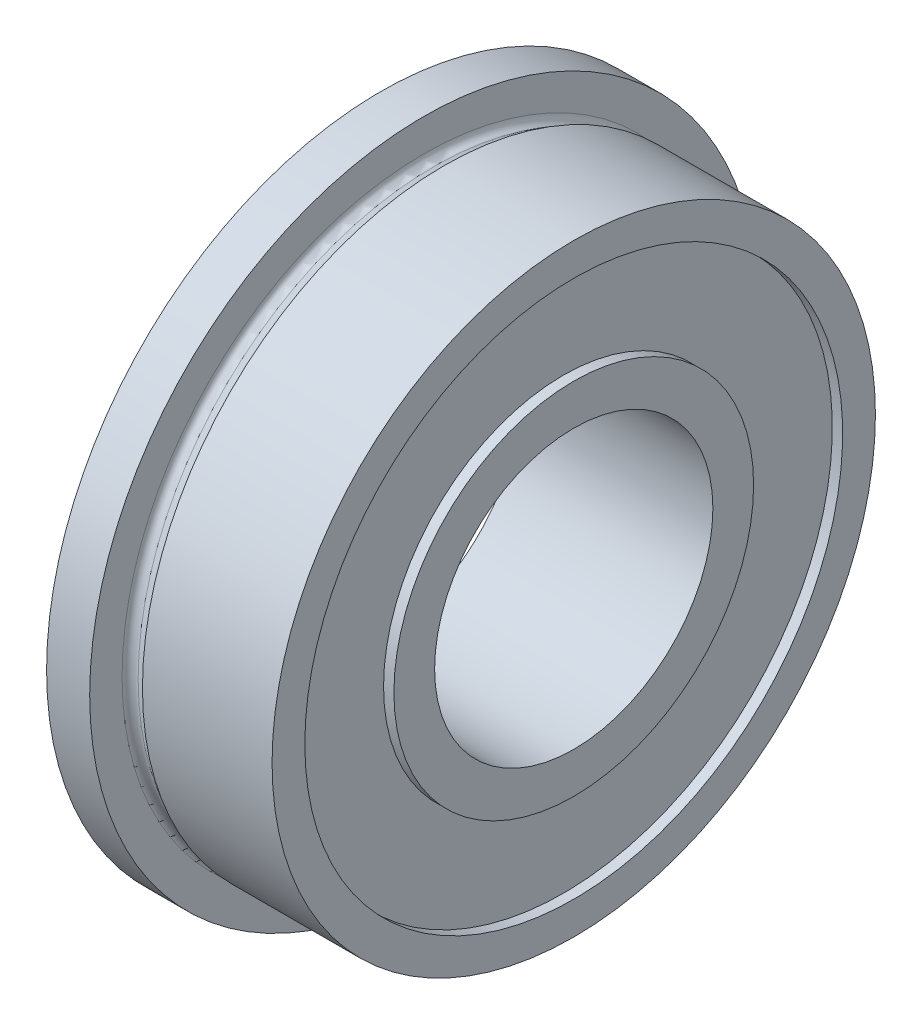
ISO-10303-21;
HEADER;
FILE_DESCRIPTION(('STEP AP214'),'2;1');
FILE_NAME('part.step','',(''),(''),'','','');
FILE_SCHEMA(('AUTOMOTIVE_DESIGN { 1 0 10303 214 1 1 1 1 }'));
ENDSEC;
DATA;
#1=APPLICATION_CONTEXT('core data for automotive mechanical design processes');
#2=APPLICATION_PROTOCOL_DEFINITION('international standard','automotive_design',2000,#1);
#3=PRODUCT_CONTEXT('',#1,'mechanical');
#4=PRODUCT('Part','Part','',(#3));
#5=PRODUCT_RELATED_PRODUCT_CATEGORY('part','',(#4));
#6=PRODUCT_DEFINITION_FORMATION('','',#4);
#7=PRODUCT_DEFINITION_CONTEXT('part definition',#1,'design');
#8=PRODUCT_DEFINITION('design','',#6,#7);
#9=PRODUCT_DEFINITION_SHAPE('','',#8);
#10=(LENGTH_UNIT() NAMED_UNIT(*) SI_UNIT(.MILLI.,.METRE.));
#11=(NAMED_UNIT(*) PLANE_ANGLE_UNIT() SI_UNIT($,.RADIAN.));
#12=(NAMED_UNIT(*) SI_UNIT($,.STERADIAN.) SOLID_ANGLE_UNIT());
#13=UNCERTAINTY_MEASURE_WITH_UNIT(LENGTH_MEASURE(1.E-05),#10,'distance_accuracy_value','');
#14=(GEOMETRIC_REPRESENTATION_CONTEXT(3) GLOBAL_UNCERTAINTY_ASSIGNED_CONTEXT((#13)) GLOBAL_UNIT_ASSIGNED_CONTEXT((#10,
#11,#12)) REPRESENTATION_CONTEXT('',''));
#15=CARTESIAN_POINT('',(0.,0.,0.));
#16=DIRECTION('',(0.,0.,1.));
#17=DIRECTION('',(1.,0.,0.));
#18=AXIS2_PLACEMENT_3D('',#15,#16,#17);
#19=CARTESIAN_POINT('',(1.9625,0.,0.));
#20=DIRECTION('',(1.,0.,0.));
#21=DIRECTION('',(0.,0.,-1.));
#22=AXIS2_PLACEMENT_3D('',#19,#20,#21);
#23=CONICAL_SURFACE('',#22,10.8959936490539,0.523598775598302);
#24=CARTESIAN_POINT('',(2.3375,0.,0.));
#25=DIRECTION('',(-1.,0.,0.));
#26=DIRECTION('',(0.,0.,1.));
#27=AXIS2_PLACEMENT_3D('',#24,#25,#26);
#28=CIRCLE('',#27,11.1125);
#29=CARTESIAN_POINT('',(2.3375,0.,11.1125));
#30=VERTEX_POINT('',#29);
#31=EDGE_CURVE('E87',#30,#30,#28,.T.);
#32=ORIENTED_EDGE('',*,*,#31,.T.);
#33=EDGE_LOOP('',(#32));
#34=FACE_BOUND('',#33,.T.);
#35=CARTESIAN_POINT('',(1.9625,0.,0.));
#36=DIRECTION('',(-1.,0.,0.));
#37=DIRECTION('',(0.,0.,1.));
#38=AXIS2_PLACEMENT_3D('',#35,#36,#37);
#39=CIRCLE('',#38,10.8959936490539);
#40=CARTESIAN_POINT('',(1.9625,0.,10.8959936490539));
#41=VERTEX_POINT('',#40);
#42=EDGE_CURVE('E10',#41,#41,#39,.T.);
#43=ORIENTED_EDGE('',*,*,#42,.F.);
#44=EDGE_LOOP('',(#43));
#45=FACE_BOUND('',#44,.T.);
#46=ADVANCED_FACE('F35',(#34,#45),#23,.T.);
#47=CARTESIAN_POINT('',(1.8375,0.,0.));
#48=DIRECTION('',(-1.,0.,0.));
#49=DIRECTION('',(0.,0.,1.));
#50=AXIS2_PLACEMENT_3D('',#47,#48,#49);
#51=TOROIDAL_SURFACE('',#50,11.1125,0.250000000000001);
#52=ORIENTED_EDGE('',*,*,#42,.T.);
#53=EDGE_LOOP('',(#52));
#54=FACE_BOUND('',#53,.T.);
#55=CARTESIAN_POINT('',(1.5875,0.,0.));
#56=DIRECTION('',(-1.,0.,0.));
#57=DIRECTION('',(0.,0.,1.));
#58=AXIS2_PLACEMENT_3D('',#55,#56,#57);
#59=CIRCLE('',#58,11.1125);
#60=CARTESIAN_POINT('',(1.5875,0.,11.1125));
#61=VERTEX_POINT('',#60);
#62=EDGE_CURVE('E41',#61,#61,#59,.T.);
#63=ORIENTED_EDGE('',*,*,#62,.F.);
#64=EDGE_LOOP('',(#63));
#65=FACE_BOUND('',#64,.T.);
#66=ADVANCED_FACE('F105',(#54,#65),#51,.F.);
#67=CARTESIAN_POINT('',(1.5875,12.3063,0.));
#68=DIRECTION('',(1.,0.,0.));
#69=DIRECTION('',(0.,0.,-1.));
#70=AXIS2_PLACEMENT_3D('',#67,#68,#69);
#71=PLANE('',#70);
#72=ORIENTED_EDGE('',*,*,#62,.T.);
#73=EDGE_LOOP('',(#72));
#74=FACE_BOUND('',#73,.T.);
#75=CARTESIAN_POINT('',(1.5875,0.,0.));
#76=DIRECTION('',(-1.,0.,0.));
#77=DIRECTION('',(0.,0.,1.));
#78=AXIS2_PLACEMENT_3D('',#75,#76,#77);
#79=CIRCLE('',#78,12.3063);
#80=CARTESIAN_POINT('',(1.5875,0.,12.3063));
#81=VERTEX_POINT('',#80);
#82=EDGE_CURVE('E45',#81,#81,#79,.T.);
#83=ORIENTED_EDGE('',*,*,#82,.F.);
#84=EDGE_LOOP('',(#83));
#85=FACE_BOUND('',#84,.T.);
#86=ADVANCED_FACE('F109',(#74,#85),#71,.T.);
#87=CARTESIAN_POINT('',(7.112,0.,0.));
#88=DIRECTION('',(-1.,0.,0.));
#89=DIRECTION('',(0.,0.,1.));
#90=AXIS2_PLACEMENT_3D('',#87,#88,#89);
#91=CYLINDRICAL_SURFACE('',#90,12.3063);
#92=ORIENTED_EDGE('',*,*,#82,.T.);
#93=EDGE_LOOP('',(#92));
#94=FACE_BOUND('',#93,.T.);
#95=CARTESIAN_POINT('',(0.,0.,0.));
#96=DIRECTION('',(-1.,0.,0.));
#97=DIRECTION('',(0.,0.,1.));
#98=AXIS2_PLACEMENT_3D('',#95,#96,#97);
#99=CIRCLE('',#98,12.3063);
#100=CARTESIAN_POINT('',(0.,0.,12.3063));
#101=VERTEX_POINT('',#100);
#102=EDGE_CURVE('E49',#101,#101,#99,.T.);
#103=ORIENTED_EDGE('',*,*,#102,.F.);
#104=EDGE_LOOP('',(#103));
#105=FACE_BOUND('',#104,.T.);
#106=ADVANCED_FACE('F113',(#94,#105),#91,.T.);
#107=CARTESIAN_POINT('',(0.,9.906,0.));
#108=DIRECTION('',(-1.,0.,0.));
#109=DIRECTION('',(0.,0.,1.));
#110=AXIS2_PLACEMENT_3D('',#107,#108,#109);
#111=PLANE('',#110);
#112=ORIENTED_EDGE('',*,*,#102,.T.);
#113=EDGE_LOOP('',(#112));
#114=FACE_BOUND('',#113,.T.);
#115=CARTESIAN_POINT('',(0.,0.,0.));
#116=DIRECTION('',(-1.,0.,0.));
#117=DIRECTION('',(0.,0.,1.));
#118=AXIS2_PLACEMENT_3D('',#115,#116,#117);
#119=CIRCLE('',#118,9.906);
#120=CARTESIAN_POINT('',(0.,0.,9.906));
#121=VERTEX_POINT('',#120);
#122=EDGE_CURVE('E54',#121,#121,#119,.T.);
#123=ORIENTED_EDGE('',*,*,#122,.F.);
#124=EDGE_LOOP('',(#123));
#125=FACE_BOUND('',#124,.T.);
#126=ADVANCED_FACE('F119',(#114,#125),#111,.T.);
#127=CARTESIAN_POINT('',(7.112,0.,0.));
#128=DIRECTION('',(-1.,0.,0.));
#129=DIRECTION('',(0.,0.,1.));
#130=AXIS2_PLACEMENT_3D('',#127,#128,#129);
#131=CYLINDRICAL_SURFACE('',#130,9.906);
#132=ORIENTED_EDGE('',*,*,#122,.T.);
#133=EDGE_LOOP('',(#132));
#134=FACE_BOUND('',#133,.T.);
#135=CARTESIAN_POINT('',(0.380999999999999,0.,0.));
#136=DIRECTION('',(-1.,0.,0.));
#137=DIRECTION('',(0.,0.,1.));
#138=AXIS2_PLACEMENT_3D('',#135,#136,#137);
#139=CIRCLE('',#138,9.906);
#140=CARTESIAN_POINT('',(0.380999999999999,0.,9.906));
#141=VERTEX_POINT('',#140);
#142=EDGE_CURVE('E57',#141,#141,#139,.T.);
#143=ORIENTED_EDGE('',*,*,#142,.F.);
#144=EDGE_LOOP('',(#143));
#145=FACE_BOUND('',#144,.T.);
#146=ADVANCED_FACE('F123',(#134,#145),#131,.F.);
#147=CARTESIAN_POINT('',(0.380999999999999,6.625,0.));
#148=DIRECTION('',(-1.,0.,0.));
#149=DIRECTION('',(0.,0.,1.));
#150=AXIS2_PLACEMENT_3D('',#147,#148,#149);
#151=PLANE('',#150);
#152=ORIENTED_EDGE('',*,*,#142,.T.);
#153=EDGE_LOOP('',(#152));
#154=FACE_BOUND('',#153,.T.);
#155=CARTESIAN_POINT('',(0.380999999999999,0.,0.));
#156=DIRECTION('',(-1.,0.,0.));
#157=DIRECTION('',(0.,0.,1.));
#158=AXIS2_PLACEMENT_3D('',#155,#156,#157);
#159=CIRCLE('',#158,6.625);
#160=CARTESIAN_POINT('',(0.380999999999999,0.,6.625));
#161=VERTEX_POINT('',#160);
#162=EDGE_CURVE('E60',#161,#161,#159,.T.);
#163=ORIENTED_EDGE('',*,*,#162,.F.);
#164=EDGE_LOOP('',(#163));
#165=FACE_BOUND('',#164,.T.);
#166=ADVANCED_FACE('F127',(#154,#165),#151,.T.);
#167=CARTESIAN_POINT('',(7.112,0.,0.));
#168=DIRECTION('',(-1.,0.,0.));
#169=DIRECTION('',(0.,0.,1.));
#170=AXIS2_PLACEMENT_3D('',#167,#168,#169);
#171=CYLINDRICAL_SURFACE('',#170,6.625);
#172=ORIENTED_EDGE('',*,*,#162,.T.);
#173=EDGE_LOOP('',(#172));
#174=FACE_BOUND('',#173,.T.);
#175=CARTESIAN_POINT('',(0.,0.,0.));
#176=DIRECTION('',(-1.,0.,0.));
#177=DIRECTION('',(0.,0.,1.));
#178=AXIS2_PLACEMENT_3D('',#175,#176,#177);
#179=CIRCLE('',#178,6.625);
#180=CARTESIAN_POINT('',(0.,0.,6.625));
#181=VERTEX_POINT('',#180);
#182=EDGE_CURVE('E63',#181,#181,#179,.T.);
#183=ORIENTED_EDGE('',*,*,#182,.F.);
#184=EDGE_LOOP('',(#183));
#185=FACE_BOUND('',#184,.T.);
#186=ADVANCED_FACE('F131',(#174,#185),#171,.T.);
#187=CARTESIAN_POINT('',(0.,5.125,0.));
#188=DIRECTION('',(-1.,0.,0.));
#189=DIRECTION('',(0.,0.,1.));
#190=AXIS2_PLACEMENT_3D('',#187,#188,#189);
#191=PLANE('',#190);
#192=ORIENTED_EDGE('',*,*,#182,.T.);
#193=EDGE_LOOP('',(#192));
#194=FACE_BOUND('',#193,.T.);
#195=CARTESIAN_POINT('',(0.,0.,0.));
#196=DIRECTION('',(-1.,0.,0.));
#197=DIRECTION('',(0.,0.,1.));
#198=AXIS2_PLACEMENT_3D('',#195,#196,#197);
#199=CIRCLE('',#198,5.125);
#200=CARTESIAN_POINT('',(0.,0.,5.125));
#201=VERTEX_POINT('',#200);
#202=EDGE_CURVE('E66',#201,#201,#199,.T.);
#203=ORIENTED_EDGE('',*,*,#202,.F.);
#204=EDGE_LOOP('',(#203));
#205=FACE_BOUND('',#204,.T.);
#206=ADVANCED_FACE('F135',(#194,#205),#191,.T.);
#207=CARTESIAN_POINT('',(7.112,0.,0.));
#208=DIRECTION('',(-1.,0.,0.));
#209=DIRECTION('',(0.,0.,1.));
#210=AXIS2_PLACEMENT_3D('',#207,#208,#209);
#211=CYLINDRICAL_SURFACE('',#210,5.125);
#212=ORIENTED_EDGE('',*,*,#202,.T.);
#213=EDGE_LOOP('',(#212));
#214=FACE_BOUND('',#213,.T.);
#215=CARTESIAN_POINT('',(7.112,0.,0.));
#216=DIRECTION('',(-1.,0.,0.));
#217=DIRECTION('',(0.,0.,1.));
#218=AXIS2_PLACEMENT_3D('',#215,#216,#217);
#219=CIRCLE('',#218,5.125);
#220=CARTESIAN_POINT('',(7.112,0.,5.125));
#221=VERTEX_POINT('',#220);
#222=EDGE_CURVE('E69',#221,#221,#219,.T.);
#223=ORIENTED_EDGE('',*,*,#222,.F.);
#224=EDGE_LOOP('',(#223));
#225=FACE_BOUND('',#224,.T.);
#226=ADVANCED_FACE('F139',(#214,#225),#211,.F.);
#227=CARTESIAN_POINT('',(7.112,6.625,0.));
#228=DIRECTION('',(1.,0.,0.));
#229=DIRECTION('',(0.,0.,-1.));
#230=AXIS2_PLACEMENT_3D('',#227,#228,#229);
#231=PLANE('',#230);
#232=ORIENTED_EDGE('',*,*,#222,.T.);
#233=EDGE_LOOP('',(#232));
#234=FACE_BOUND('',#233,.T.);
#235=CARTESIAN_POINT('',(7.112,0.,0.));
#236=DIRECTION('',(-1.,0.,0.));
#237=DIRECTION('',(0.,0.,1.));
#238=AXIS2_PLACEMENT_3D('',#235,#236,#237);
#239=CIRCLE('',#238,6.625);
#240=CARTESIAN_POINT('',(7.112,0.,6.625));
#241=VERTEX_POINT('',#240);
#242=EDGE_CURVE('E72',#241,#241,#239,.T.);
#243=ORIENTED_EDGE('',*,*,#242,.F.);
#244=EDGE_LOOP('',(#243));
#245=FACE_BOUND('',#244,.T.);
#246=ADVANCED_FACE('F143',(#234,#245),#231,.T.);
#247=CARTESIAN_POINT('',(7.112,0.,0.));
#248=DIRECTION('',(-1.,0.,0.));
#249=DIRECTION('',(0.,0.,1.));
#250=AXIS2_PLACEMENT_3D('',#247,#248,#249);
#251=CYLINDRICAL_SURFACE('',#250,6.625);
#252=ORIENTED_EDGE('',*,*,#242,.T.);
#253=EDGE_LOOP('',(#252));
#254=FACE_BOUND('',#253,.T.);
#255=CARTESIAN_POINT('',(6.731,0.,0.));
#256=DIRECTION('',(-1.,0.,0.));
#257=DIRECTION('',(0.,0.,1.));
#258=AXIS2_PLACEMENT_3D('',#255,#256,#257);
#259=CIRCLE('',#258,6.625);
#260=CARTESIAN_POINT('',(6.731,0.,6.625));
#261=VERTEX_POINT('',#260);
#262=EDGE_CURVE('E75',#261,#261,#259,.T.);
#263=ORIENTED_EDGE('',*,*,#262,.F.);
#264=EDGE_LOOP('',(#263));
#265=FACE_BOUND('',#264,.T.);
#266=ADVANCED_FACE('F147',(#254,#265),#251,.T.);
#267=CARTESIAN_POINT('',(6.731,9.906,0.));
#268=DIRECTION('',(1.,0.,0.));
#269=DIRECTION('',(0.,0.,-1.));
#270=AXIS2_PLACEMENT_3D('',#267,#268,#269);
#271=PLANE('',#270);
#272=ORIENTED_EDGE('',*,*,#262,.T.);
#273=EDGE_LOOP('',(#272));
#274=FACE_BOUND('',#273,.T.);
#275=CARTESIAN_POINT('',(6.731,0.,0.));
#276=DIRECTION('',(-1.,0.,0.));
#277=DIRECTION('',(0.,0.,1.));
#278=AXIS2_PLACEMENT_3D('',#275,#276,#277);
#279=CIRCLE('',#278,9.906);
#280=CARTESIAN_POINT('',(6.731,0.,9.906));
#281=VERTEX_POINT('',#280);
#282=EDGE_CURVE('E78',#281,#281,#279,.T.);
#283=ORIENTED_EDGE('',*,*,#282,.F.);
#284=EDGE_LOOP('',(#283));
#285=FACE_BOUND('',#284,.T.);
#286=ADVANCED_FACE('F151',(#274,#285),#271,.T.);
#287=CARTESIAN_POINT('',(7.112,0.,0.));
#288=DIRECTION('',(-1.,0.,0.));
#289=DIRECTION('',(0.,0.,1.));
#290=AXIS2_PLACEMENT_3D('',#287,#288,#289);
#291=CYLINDRICAL_SURFACE('',#290,9.906);
#292=ORIENTED_EDGE('',*,*,#282,.T.);
#293=EDGE_LOOP('',(#292));
#294=FACE_BOUND('',#293,.T.);
#295=CARTESIAN_POINT('',(7.112,0.,0.));
#296=DIRECTION('',(-1.,0.,0.));
#297=DIRECTION('',(0.,0.,1.));
#298=AXIS2_PLACEMENT_3D('',#295,#296,#297);
#299=CIRCLE('',#298,9.906);
#300=CARTESIAN_POINT('',(7.112,0.,9.906));
#301=VERTEX_POINT('',#300);
#302=EDGE_CURVE('E81',#301,#301,#299,.T.);
#303=ORIENTED_EDGE('',*,*,#302,.F.);
#304=EDGE_LOOP('',(#303));
#305=FACE_BOUND('',#304,.T.);
#306=ADVANCED_FACE('F101',(#294,#305),#291,.F.);
#307=CARTESIAN_POINT('',(7.112,11.1125,0.));
#308=DIRECTION('',(1.,0.,0.));
#309=DIRECTION('',(0.,0.,-1.));
#310=AXIS2_PLACEMENT_3D('',#307,#308,#309);
#311=PLANE('',#310);
#312=ORIENTED_EDGE('',*,*,#302,.T.);
#313=EDGE_LOOP('',(#312));
#314=FACE_BOUND('',#313,.T.);
#315=CARTESIAN_POINT('',(7.112,0.,0.));
#316=DIRECTION('',(-1.,0.,0.));
#317=DIRECTION('',(0.,0.,1.));
#318=AXIS2_PLACEMENT_3D('',#315,#316,#317);
#319=CIRCLE('',#318,11.1125);
#320=CARTESIAN_POINT('',(7.112,0.,11.1125));
#321=VERTEX_POINT('',#320);
#322=EDGE_CURVE('E84',#321,#321,#319,.T.);
#323=ORIENTED_EDGE('',*,*,#322,.F.);
#324=EDGE_LOOP('',(#323));
#325=FACE_BOUND('',#324,.T.);
#326=ADVANCED_FACE('F95',(#314,#325),#311,.T.);
#327=CARTESIAN_POINT('',(7.112,0.,0.));
#328=DIRECTION('',(-1.,0.,0.));
#329=DIRECTION('',(0.,0.,1.));
#330=AXIS2_PLACEMENT_3D('',#327,#328,#329);
#331=CYLINDRICAL_SURFACE('',#330,11.1125);
#332=ORIENTED_EDGE('',*,*,#322,.T.);
#333=EDGE_LOOP('',(#332));
#334=FACE_BOUND('',#333,.T.);
#335=ORIENTED_EDGE('',*,*,#31,.F.);
#336=EDGE_LOOP('',(#335));
#337=FACE_BOUND('',#336,.T.);
#338=ADVANCED_FACE('F93',(#334,#337),#331,.T.);
#339=CLOSED_SHELL('',(#46,#66,#86,#106,#126,#146,#166,#186,#206,#226,#246,#266,#286,#306,#326,#338));
#340=MANIFOLD_SOLID_BREP('B2',#339);
#341=ADVANCED_BREP_SHAPE_REPRESENTATION('',(#18,#340),#14);
#342=SHAPE_DEFINITION_REPRESENTATION(#9,#341);
ENDSEC;
END-ISO-10303-21;
